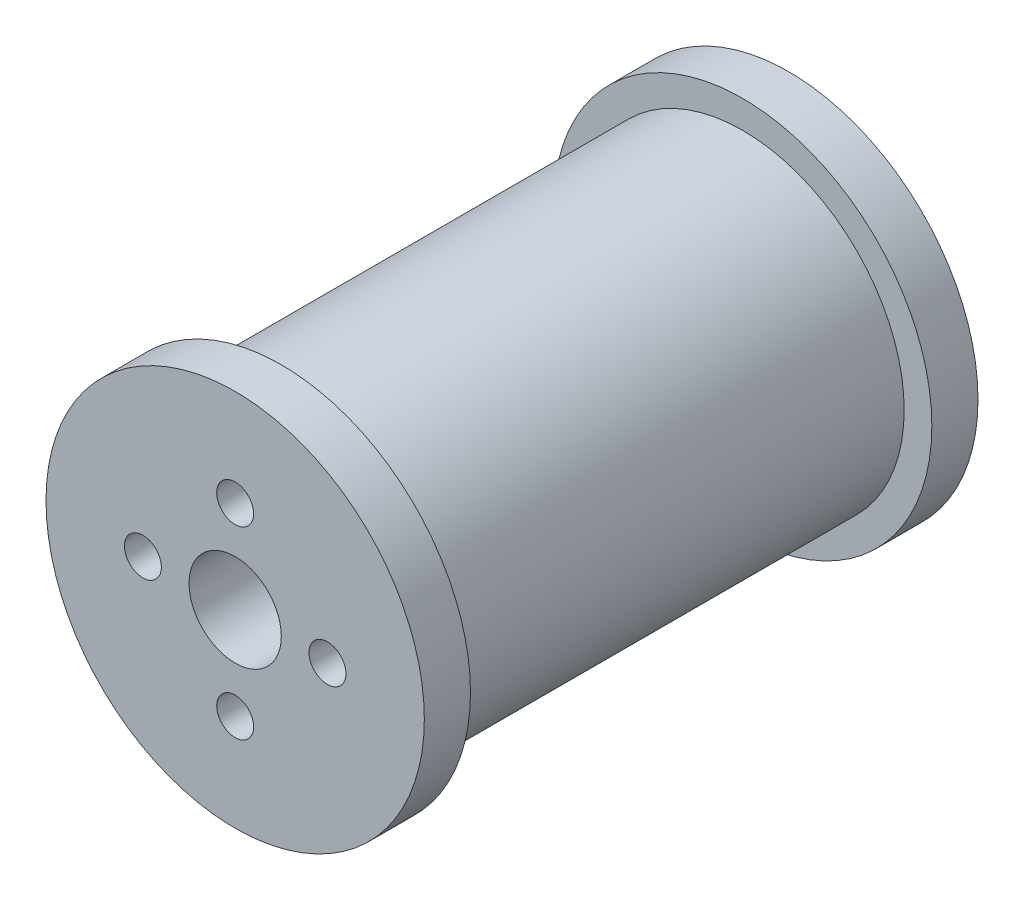
ISO-10303-21;
HEADER;
FILE_DESCRIPTION(('STEP AP214'),'2;1');
FILE_NAME('part.step','',(''),(''),'','','');
FILE_SCHEMA(('AUTOMOTIVE_DESIGN { 1 0 10303 214 1 1 1 1 }'));
ENDSEC;
DATA;
#1=APPLICATION_CONTEXT('core data for automotive mechanical design processes');
#2=APPLICATION_PROTOCOL_DEFINITION('international standard','automotive_design',2000,#1);
#3=PRODUCT_CONTEXT('',#1,'mechanical');
#4=PRODUCT('Part','Part','',(#3));
#5=PRODUCT_RELATED_PRODUCT_CATEGORY('part','',(#4));
#6=PRODUCT_DEFINITION_FORMATION('','',#4);
#7=PRODUCT_DEFINITION_CONTEXT('part definition',#1,'design');
#8=PRODUCT_DEFINITION('design','',#6,#7);
#9=PRODUCT_DEFINITION_SHAPE('','',#8);
#10=(LENGTH_UNIT() NAMED_UNIT(*) SI_UNIT(.MILLI.,.METRE.));
#11=(NAMED_UNIT(*) PLANE_ANGLE_UNIT() SI_UNIT($,.RADIAN.));
#12=(NAMED_UNIT(*) SI_UNIT($,.STERADIAN.) SOLID_ANGLE_UNIT());
#13=UNCERTAINTY_MEASURE_WITH_UNIT(LENGTH_MEASURE(1.E-05),#10,'distance_accuracy_value','');
#14=(GEOMETRIC_REPRESENTATION_CONTEXT(3) GLOBAL_UNCERTAINTY_ASSIGNED_CONTEXT((#13)) GLOBAL_UNIT_ASSIGNED_CONTEXT((#10,
#11,#12)) REPRESENTATION_CONTEXT('',''));
#15=CARTESIAN_POINT('',(0.,0.,0.));
#16=DIRECTION('',(0.,0.,1.));
#17=DIRECTION('',(1.,0.,0.));
#18=AXIS2_PLACEMENT_3D('',#15,#16,#17);
#19=CARTESIAN_POINT('',(0.,0.,50.));
#20=DIRECTION('',(0.,0.,-1.));
#21=DIRECTION('',(-1.,0.,0.));
#22=AXIS2_PLACEMENT_3D('',#19,#20,#21);
#23=CYLINDRICAL_SURFACE('',#22,17.5);
#24=CARTESIAN_POINT('',(0.,0.,50.));
#25=DIRECTION('',(0.,0.,1.));
#26=DIRECTION('',(1.,0.,0.));
#27=AXIS2_PLACEMENT_3D('',#24,#25,#26);
#28=CIRCLE('',#27,17.5);
#29=CARTESIAN_POINT('',(17.5,0.,50.));
#30=VERTEX_POINT('',#29);
#31=EDGE_CURVE('E11',#30,#30,#28,.T.);
#32=ORIENTED_EDGE('',*,*,#31,.F.);
#33=EDGE_LOOP('',(#32));
#34=FACE_BOUND('',#33,.T.);
#35=CARTESIAN_POINT('',(0.,0.,0.));
#36=DIRECTION('',(0.,0.,1.));
#37=DIRECTION('',(1.,0.,0.));
#38=AXIS2_PLACEMENT_3D('',#35,#36,#37);
#39=CIRCLE('',#38,17.5);
#40=CARTESIAN_POINT('',(17.5,0.,0.));
#41=VERTEX_POINT('',#40);
#42=EDGE_CURVE('E71',#41,#41,#39,.T.);
#43=ORIENTED_EDGE('',*,*,#42,.T.);
#44=EDGE_LOOP('',(#43));
#45=FACE_BOUND('',#44,.T.);
#46=ADVANCED_FACE('F68',(#34,#45),#23,.T.);
#47=CARTESIAN_POINT('',(0.,0.,50.));
#48=DIRECTION('',(0.,0.,-1.));
#49=DIRECTION('',(-1.,0.,0.));
#50=AXIS2_PLACEMENT_3D('',#47,#48,#49);
#51=CYLINDRICAL_SURFACE('',#50,5.);
#52=CARTESIAN_POINT('',(0.,0.,55.));
#53=DIRECTION('',(0.,0.,1.));
#54=DIRECTION('',(1.,0.,0.));
#55=AXIS2_PLACEMENT_3D('',#52,#53,#54);
#56=CIRCLE('',#55,5.);
#57=CARTESIAN_POINT('',(5.,0.,55.));
#58=VERTEX_POINT('',#57);
#59=EDGE_CURVE('E96',#58,#58,#56,.T.);
#60=ORIENTED_EDGE('',*,*,#59,.T.);
#61=EDGE_LOOP('',(#60));
#62=FACE_BOUND('',#61,.T.);
#63=CARTESIAN_POINT('',(0.,0.,-5.));
#64=DIRECTION('',(0.,0.,-1.));
#65=DIRECTION('',(-1.,0.,0.));
#66=AXIS2_PLACEMENT_3D('',#63,#64,#65);
#67=CIRCLE('',#66,5.);
#68=CARTESIAN_POINT('',(-5.,0.,-5.));
#69=VERTEX_POINT('',#68);
#70=EDGE_CURVE('E103',#69,#69,#67,.T.);
#71=ORIENTED_EDGE('',*,*,#70,.T.);
#72=EDGE_LOOP('',(#71));
#73=FACE_BOUND('',#72,.T.);
#74=ADVANCED_FACE('F142',(#62,#73),#51,.F.);
#75=CARTESIAN_POINT('',(0.,10.,50.));
#76=DIRECTION('',(0.,0.,-1.));
#77=DIRECTION('',(-1.,0.,0.));
#78=AXIS2_PLACEMENT_3D('',#75,#76,#77);
#79=CYLINDRICAL_SURFACE('',#78,2.);
#80=CARTESIAN_POINT('',(0.,10.,55.));
#81=DIRECTION('',(0.,0.,1.));
#82=DIRECTION('',(1.,0.,0.));
#83=AXIS2_PLACEMENT_3D('',#80,#81,#82);
#84=CIRCLE('',#83,2.);
#85=CARTESIAN_POINT('',(2.,10.,55.));
#86=VERTEX_POINT('',#85);
#87=EDGE_CURVE('E87',#86,#86,#84,.T.);
#88=ORIENTED_EDGE('',*,*,#87,.T.);
#89=EDGE_LOOP('',(#88));
#90=FACE_BOUND('',#89,.T.);
#91=CARTESIAN_POINT('',(0.,10.,-5.));
#92=DIRECTION('',(0.,0.,-1.));
#93=DIRECTION('',(-1.,0.,0.));
#94=AXIS2_PLACEMENT_3D('',#91,#92,#93);
#95=CIRCLE('',#94,2.);
#96=CARTESIAN_POINT('',(-2.,10.,-5.));
#97=VERTEX_POINT('',#96);
#98=EDGE_CURVE('E108',#97,#97,#95,.T.);
#99=ORIENTED_EDGE('',*,*,#98,.T.);
#100=EDGE_LOOP('',(#99));
#101=FACE_BOUND('',#100,.T.);
#102=ADVANCED_FACE('F147',(#90,#101),#79,.F.);
#103=CARTESIAN_POINT('',(10.0000000000003,2.82380124105319E-13,50.));
#104=DIRECTION('',(0.,0.,-1.));
#105=DIRECTION('',(-1.,0.,0.));
#106=AXIS2_PLACEMENT_3D('',#103,#104,#105);
#107=CYLINDRICAL_SURFACE('',#106,2.00000000000022);
#108=CARTESIAN_POINT('',(10.,0.,55.));
#109=DIRECTION('',(0.,0.,1.));
#110=DIRECTION('',(1.,0.,0.));
#111=AXIS2_PLACEMENT_3D('',#108,#109,#110);
#112=CIRCLE('',#111,2.);
#113=CARTESIAN_POINT('',(12.,0.,55.));
#114=VERTEX_POINT('',#113);
#115=EDGE_CURVE('E90',#114,#114,#112,.T.);
#116=ORIENTED_EDGE('',*,*,#115,.T.);
#117=EDGE_LOOP('',(#116));
#118=FACE_BOUND('',#117,.T.);
#119=CARTESIAN_POINT('',(9.99999999999972,-2.83604770904466E-13,-5.));
#120=DIRECTION('',(0.,0.,-1.));
#121=DIRECTION('',(-1.,0.,0.));
#122=AXIS2_PLACEMENT_3D('',#119,#120,#121);
#123=CIRCLE('',#122,2.00000000000045);
#124=CARTESIAN_POINT('',(7.99999999999927,-2.83604770904466E-13,-5.));
#125=VERTEX_POINT('',#124);
#126=EDGE_CURVE('E117',#125,#125,#123,.T.);
#127=ORIENTED_EDGE('',*,*,#126,.T.);
#128=EDGE_LOOP('',(#127));
#129=FACE_BOUND('',#128,.T.);
#130=ADVANCED_FACE('F121',(#118,#129),#107,.F.);
#131=CARTESIAN_POINT('',(5.64760248210638E-13,-10.,50.));
#132=DIRECTION('',(0.,0.,-1.));
#133=DIRECTION('',(-1.,0.,0.));
#134=AXIS2_PLACEMENT_3D('',#131,#132,#133);
#135=CYLINDRICAL_SURFACE('',#134,2.00000000000061);
#136=CARTESIAN_POINT('',(0.,-10.,55.));
#137=DIRECTION('',(0.,0.,1.));
#138=DIRECTION('',(1.,0.,0.));
#139=AXIS2_PLACEMENT_3D('',#136,#137,#138);
#140=CIRCLE('',#139,2.);
#141=CARTESIAN_POINT('',(1.99999999999993,-10.,55.));
#142=VERTEX_POINT('',#141);
#143=EDGE_CURVE('E93',#142,#142,#140,.T.);
#144=ORIENTED_EDGE('',*,*,#143,.T.);
#145=EDGE_LOOP('',(#144));
#146=FACE_BOUND('',#145,.T.);
#147=CARTESIAN_POINT('',(-5.64760248210638E-13,-10.,-5.));
#148=DIRECTION('',(0.,0.,-1.));
#149=DIRECTION('',(-1.,0.,0.));
#150=AXIS2_PLACEMENT_3D('',#147,#148,#149);
#151=CIRCLE('',#150,2.00000000000061);
#152=CARTESIAN_POINT('',(-2.00000000000117,-10.,-5.));
#153=VERTEX_POINT('',#152);
#154=EDGE_CURVE('E114',#153,#153,#151,.T.);
#155=ORIENTED_EDGE('',*,*,#154,.T.);
#156=EDGE_LOOP('',(#155));
#157=FACE_BOUND('',#156,.T.);
#158=ADVANCED_FACE('F171',(#146,#157),#135,.F.);
#159=CARTESIAN_POINT('',(-9.99999999999972,-2.83604770904466E-13,50.));
#160=DIRECTION('',(0.,0.,-1.));
#161=DIRECTION('',(-1.,0.,0.));
#162=AXIS2_PLACEMENT_3D('',#159,#160,#161);
#163=CYLINDRICAL_SURFACE('',#162,2.00000000000045);
#164=CARTESIAN_POINT('',(-10.,0.,55.));
#165=DIRECTION('',(0.,0.,1.));
#166=DIRECTION('',(1.,0.,0.));
#167=AXIS2_PLACEMENT_3D('',#164,#165,#166);
#168=CIRCLE('',#167,2.0000000000001);
#169=CARTESIAN_POINT('',(-7.9999999999999,0.,55.));
#170=VERTEX_POINT('',#169);
#171=EDGE_CURVE('E83',#170,#170,#168,.T.);
#172=ORIENTED_EDGE('',*,*,#171,.T.);
#173=EDGE_LOOP('',(#172));
#174=FACE_BOUND('',#173,.T.);
#175=CARTESIAN_POINT('',(-10.,0.,-5.));
#176=DIRECTION('',(0.,0.,-1.));
#177=DIRECTION('',(-1.,0.,0.));
#178=AXIS2_PLACEMENT_3D('',#175,#176,#177);
#179=CIRCLE('',#178,2.);
#180=CARTESIAN_POINT('',(-12.,0.,-5.));
#181=VERTEX_POINT('',#180);
#182=EDGE_CURVE('E111',#181,#181,#179,.T.);
#183=ORIENTED_EDGE('',*,*,#182,.T.);
#184=EDGE_LOOP('',(#183));
#185=FACE_BOUND('',#184,.T.);
#186=ADVANCED_FACE('F165',(#174,#185),#163,.F.);
#187=CARTESIAN_POINT('',(0.,0.,55.));
#188=DIRECTION('',(0.,0.,1.));
#189=DIRECTION('',(1.,0.,0.));
#190=AXIS2_PLACEMENT_3D('',#187,#188,#189);
#191=PLANE('',#190);
#192=ORIENTED_EDGE('',*,*,#143,.F.);
#193=EDGE_LOOP('',(#192));
#194=FACE_BOUND('',#193,.T.);
#195=ORIENTED_EDGE('',*,*,#87,.F.);
#196=EDGE_LOOP('',(#195));
#197=FACE_BOUND('',#196,.T.);
#198=CARTESIAN_POINT('',(0.,0.,55.));
#199=DIRECTION('',(0.,0.,1.));
#200=DIRECTION('',(1.,0.,0.));
#201=AXIS2_PLACEMENT_3D('',#198,#199,#200);
#202=CIRCLE('',#201,20.5);
#203=CARTESIAN_POINT('',(20.5,0.,55.));
#204=VERTEX_POINT('',#203);
#205=EDGE_CURVE('E75',#204,#204,#202,.T.);
#206=ORIENTED_EDGE('',*,*,#205,.T.);
#207=EDGE_LOOP('',(#206));
#208=FACE_BOUND('',#207,.T.);
#209=ORIENTED_EDGE('',*,*,#171,.F.);
#210=EDGE_LOOP('',(#209));
#211=FACE_BOUND('',#210,.T.);
#212=ORIENTED_EDGE('',*,*,#115,.F.);
#213=EDGE_LOOP('',(#212));
#214=FACE_BOUND('',#213,.T.);
#215=ORIENTED_EDGE('',*,*,#59,.F.);
#216=EDGE_LOOP('',(#215));
#217=FACE_BOUND('',#216,.T.);
#218=ADVANCED_FACE('F162',(#194,#197,#208,#211,#214,#217),#191,.T.);
#219=CARTESIAN_POINT('',(0.,0.,50.));
#220=DIRECTION('',(0.,0.,1.));
#221=DIRECTION('',(1.,0.,0.));
#222=AXIS2_PLACEMENT_3D('',#219,#220,#221);
#223=PLANE('',#222);
#224=ORIENTED_EDGE('',*,*,#31,.T.);
#225=EDGE_LOOP('',(#224));
#226=FACE_BOUND('',#225,.T.);
#227=CARTESIAN_POINT('',(0.,0.,50.));
#228=DIRECTION('',(0.,0.,1.));
#229=DIRECTION('',(1.,0.,0.));
#230=AXIS2_PLACEMENT_3D('',#227,#228,#229);
#231=CIRCLE('',#230,20.5);
#232=CARTESIAN_POINT('',(20.5,0.,50.));
#233=VERTEX_POINT('',#232);
#234=EDGE_CURVE('E79',#233,#233,#231,.T.);
#235=ORIENTED_EDGE('',*,*,#234,.F.);
#236=EDGE_LOOP('',(#235));
#237=FACE_BOUND('',#236,.T.);
#238=ADVANCED_FACE('F136',(#226,#237),#223,.F.);
#239=CARTESIAN_POINT('',(0.,0.,55.));
#240=DIRECTION('',(0.,0.,-1.));
#241=DIRECTION('',(-1.,0.,0.));
#242=AXIS2_PLACEMENT_3D('',#239,#240,#241);
#243=CYLINDRICAL_SURFACE('',#242,20.5);
#244=ORIENTED_EDGE('',*,*,#205,.F.);
#245=EDGE_LOOP('',(#244));
#246=FACE_BOUND('',#245,.T.);
#247=ORIENTED_EDGE('',*,*,#234,.T.);
#248=EDGE_LOOP('',(#247));
#249=FACE_BOUND('',#248,.T.);
#250=ADVANCED_FACE('F126',(#246,#249),#243,.T.);
#251=CARTESIAN_POINT('',(0.,0.,-5.));
#252=DIRECTION('',(0.,0.,-1.));
#253=DIRECTION('',(-1.,0.,0.));
#254=AXIS2_PLACEMENT_3D('',#251,#252,#253);
#255=PLANE('',#254);
#256=ORIENTED_EDGE('',*,*,#154,.F.);
#257=EDGE_LOOP('',(#256));
#258=FACE_BOUND('',#257,.T.);
#259=ORIENTED_EDGE('',*,*,#98,.F.);
#260=EDGE_LOOP('',(#259));
#261=FACE_BOUND('',#260,.T.);
#262=CARTESIAN_POINT('',(0.,0.,-5.));
#263=DIRECTION('',(0.,0.,-1.));
#264=DIRECTION('',(-1.,0.,0.));
#265=AXIS2_PLACEMENT_3D('',#262,#263,#264);
#266=CIRCLE('',#265,20.5);
#267=CARTESIAN_POINT('',(-20.5,0.,-5.));
#268=VERTEX_POINT('',#267);
#269=EDGE_CURVE('E102',#268,#268,#266,.T.);
#270=ORIENTED_EDGE('',*,*,#269,.T.);
#271=EDGE_LOOP('',(#270));
#272=FACE_BOUND('',#271,.T.);
#273=ORIENTED_EDGE('',*,*,#70,.F.);
#274=EDGE_LOOP('',(#273));
#275=FACE_BOUND('',#274,.T.);
#276=ORIENTED_EDGE('',*,*,#182,.F.);
#277=EDGE_LOOP('',(#276));
#278=FACE_BOUND('',#277,.T.);
#279=ORIENTED_EDGE('',*,*,#126,.F.);
#280=EDGE_LOOP('',(#279));
#281=FACE_BOUND('',#280,.T.);
#282=ADVANCED_FACE('F123',(#258,#261,#272,#275,#278,#281),#255,.T.);
#283=CARTESIAN_POINT('',(0.,0.,0.));
#284=DIRECTION('',(0.,0.,-1.));
#285=DIRECTION('',(-1.,0.,0.));
#286=AXIS2_PLACEMENT_3D('',#283,#284,#285);
#287=PLANE('',#286);
#288=ORIENTED_EDGE('',*,*,#42,.F.);
#289=EDGE_LOOP('',(#288));
#290=FACE_BOUND('',#289,.T.);
#291=CARTESIAN_POINT('',(0.,0.,0.));
#292=DIRECTION('',(0.,0.,-1.));
#293=DIRECTION('',(-1.,0.,0.));
#294=AXIS2_PLACEMENT_3D('',#291,#292,#293);
#295=CIRCLE('',#294,20.5);
#296=CARTESIAN_POINT('',(-20.5,0.,0.));
#297=VERTEX_POINT('',#296);
#298=EDGE_CURVE('E99',#297,#297,#295,.T.);
#299=ORIENTED_EDGE('',*,*,#298,.F.);
#300=EDGE_LOOP('',(#299));
#301=FACE_BOUND('',#300,.T.);
#302=ADVANCED_FACE('F125',(#290,#301),#287,.F.);
#303=CARTESIAN_POINT('',(0.,0.,-5.));
#304=DIRECTION('',(0.,0.,1.));
#305=DIRECTION('',(1.,0.,0.));
#306=AXIS2_PLACEMENT_3D('',#303,#304,#305);
#307=CYLINDRICAL_SURFACE('',#306,20.5);
#308=ORIENTED_EDGE('',*,*,#269,.F.);
#309=EDGE_LOOP('',(#308));
#310=FACE_BOUND('',#309,.T.);
#311=ORIENTED_EDGE('',*,*,#298,.T.);
#312=EDGE_LOOP('',(#311));
#313=FACE_BOUND('',#312,.T.);
#314=ADVANCED_FACE('F133',(#310,#313),#307,.T.);
#315=CLOSED_SHELL('',(#46,#74,#102,#130,#158,#186,#218,#238,#250,#282,#302,#314));
#316=MANIFOLD_SOLID_BREP('B2',#315);
#317=ADVANCED_BREP_SHAPE_REPRESENTATION('',(#18,#316),#14);
#318=SHAPE_DEFINITION_REPRESENTATION(#9,#317);
ENDSEC;
END-ISO-10303-21;
